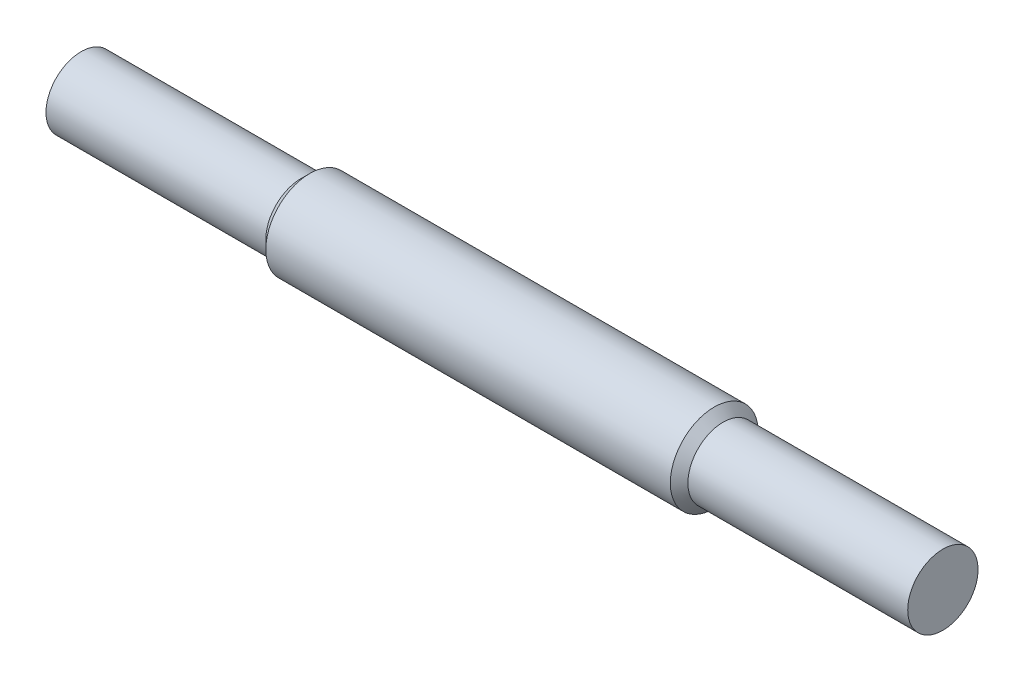
ISO-10303-21;
HEADER;
FILE_DESCRIPTION(('STEP AP214'),'2;1');
FILE_NAME('part.step','',(''),(''),'','','');
FILE_SCHEMA(('AUTOMOTIVE_DESIGN { 1 0 10303 214 1 1 1 1 }'));
ENDSEC;
DATA;
#1=APPLICATION_CONTEXT('core data for automotive mechanical design processes');
#2=APPLICATION_PROTOCOL_DEFINITION('international standard','automotive_design',2000,#1);
#3=PRODUCT_CONTEXT('',#1,'mechanical');
#4=PRODUCT('Part','Part','',(#3));
#5=PRODUCT_RELATED_PRODUCT_CATEGORY('part','',(#4));
#6=PRODUCT_DEFINITION_FORMATION('','',#4);
#7=PRODUCT_DEFINITION_CONTEXT('part definition',#1,'design');
#8=PRODUCT_DEFINITION('design','',#6,#7);
#9=PRODUCT_DEFINITION_SHAPE('','',#8);
#10=(LENGTH_UNIT() NAMED_UNIT(*) SI_UNIT(.MILLI.,.METRE.));
#11=(NAMED_UNIT(*) PLANE_ANGLE_UNIT() SI_UNIT($,.RADIAN.));
#12=(NAMED_UNIT(*) SI_UNIT($,.STERADIAN.) SOLID_ANGLE_UNIT());
#13=UNCERTAINTY_MEASURE_WITH_UNIT(LENGTH_MEASURE(1.E-05),#10,'distance_accuracy_value','');
#14=(GEOMETRIC_REPRESENTATION_CONTEXT(3) GLOBAL_UNCERTAINTY_ASSIGNED_CONTEXT((#13)) GLOBAL_UNIT_ASSIGNED_CONTEXT((#10,
#11,#12)) REPRESENTATION_CONTEXT('',''));
#15=CARTESIAN_POINT('',(0.,0.,0.));
#16=DIRECTION('',(0.,0.,1.));
#17=DIRECTION('',(1.,0.,0.));
#18=AXIS2_PLACEMENT_3D('',#15,#16,#17);
#19=CARTESIAN_POINT('',(-50.,0.,0.));
#20=DIRECTION('',(1.,0.,0.));
#21=DIRECTION('',(0.,0.,-1.));
#22=AXIS2_PLACEMENT_3D('',#19,#20,#21);
#23=PLANE('',#22);
#24=CARTESIAN_POINT('',(-50.,0.,0.));
#25=DIRECTION('',(-1.,0.,0.));
#26=DIRECTION('',(0.,0.,1.));
#27=AXIS2_PLACEMENT_3D('',#24,#25,#26);
#28=CIRCLE('',#27,4.);
#29=CARTESIAN_POINT('',(-50.,0.,4.));
#30=VERTEX_POINT('',#29);
#31=EDGE_CURVE('E10',#30,#30,#28,.T.);
#32=ORIENTED_EDGE('',*,*,#31,.T.);
#33=EDGE_LOOP('',(#32));
#34=FACE_BOUND('',#33,.T.);
#35=ADVANCED_FACE('F32',(#34),#23,.F.);
#36=CARTESIAN_POINT('',(-25.,0.,0.));
#37=DIRECTION('',(-1.,0.,0.));
#38=DIRECTION('',(0.,0.,1.));
#39=AXIS2_PLACEMENT_3D('',#36,#37,#38);
#40=CYLINDRICAL_SURFACE('',#39,4.);
#41=ORIENTED_EDGE('',*,*,#31,.F.);
#42=EDGE_LOOP('',(#41));
#43=FACE_BOUND('',#42,.T.);
#44=CARTESIAN_POINT('',(-25.,0.,0.));
#45=DIRECTION('',(-1.,0.,0.));
#46=DIRECTION('',(0.,0.,1.));
#47=AXIS2_PLACEMENT_3D('',#44,#45,#46);
#48=CIRCLE('',#47,4.);
#49=CARTESIAN_POINT('',(-25.,0.,4.));
#50=VERTEX_POINT('',#49);
#51=EDGE_CURVE('E38',#50,#50,#48,.T.);
#52=ORIENTED_EDGE('',*,*,#51,.T.);
#53=EDGE_LOOP('',(#52));
#54=FACE_BOUND('',#53,.T.);
#55=ADVANCED_FACE('F70',(#43,#54),#40,.T.);
#56=CARTESIAN_POINT('',(-24.,0.,0.));
#57=DIRECTION('',(1.,0.,0.));
#58=DIRECTION('',(0.,0.,-1.));
#59=AXIS2_PLACEMENT_3D('',#56,#57,#58);
#60=CONICAL_SURFACE('',#59,5.,0.785398163397442);
#61=ORIENTED_EDGE('',*,*,#51,.F.);
#62=EDGE_LOOP('',(#61));
#63=FACE_BOUND('',#62,.T.);
#64=CARTESIAN_POINT('',(-24.,0.,0.));
#65=DIRECTION('',(-1.,0.,0.));
#66=DIRECTION('',(0.,0.,1.));
#67=AXIS2_PLACEMENT_3D('',#64,#65,#66);
#68=CIRCLE('',#67,5.);
#69=CARTESIAN_POINT('',(-24.,0.,5.));
#70=VERTEX_POINT('',#69);
#71=EDGE_CURVE('E42',#70,#70,#68,.T.);
#72=ORIENTED_EDGE('',*,*,#71,.T.);
#73=EDGE_LOOP('',(#72));
#74=FACE_BOUND('',#73,.T.);
#75=ADVANCED_FACE('F74',(#63,#74),#60,.T.);
#76=CARTESIAN_POINT('',(-25.,0.,0.));
#77=DIRECTION('',(-1.,0.,0.));
#78=DIRECTION('',(0.,0.,1.));
#79=AXIS2_PLACEMENT_3D('',#76,#77,#78);
#80=CYLINDRICAL_SURFACE('',#79,5.);
#81=ORIENTED_EDGE('',*,*,#71,.F.);
#82=EDGE_LOOP('',(#81));
#83=FACE_BOUND('',#82,.T.);
#84=CARTESIAN_POINT('',(22.,0.,0.));
#85=DIRECTION('',(-1.,0.,0.));
#86=DIRECTION('',(0.,0.,1.));
#87=AXIS2_PLACEMENT_3D('',#84,#85,#86);
#88=CIRCLE('',#87,5.);
#89=CARTESIAN_POINT('',(22.,0.,5.));
#90=VERTEX_POINT('',#89);
#91=EDGE_CURVE('E46',#90,#90,#88,.T.);
#92=ORIENTED_EDGE('',*,*,#91,.T.);
#93=EDGE_LOOP('',(#92));
#94=FACE_BOUND('',#93,.T.);
#95=ADVANCED_FACE('F79',(#83,#94),#80,.T.);
#96=CARTESIAN_POINT('',(23.,0.,0.));
#97=DIRECTION('',(-1.,0.,0.));
#98=DIRECTION('',(0.,0.,1.));
#99=AXIS2_PLACEMENT_3D('',#96,#97,#98);
#100=CONICAL_SURFACE('',#99,4.,0.785398163397441);
#101=ORIENTED_EDGE('',*,*,#91,.F.);
#102=EDGE_LOOP('',(#101));
#103=FACE_BOUND('',#102,.T.);
#104=CARTESIAN_POINT('',(23.,0.,0.));
#105=DIRECTION('',(-1.,0.,0.));
#106=DIRECTION('',(0.,0.,1.));
#107=AXIS2_PLACEMENT_3D('',#104,#105,#106);
#108=CIRCLE('',#107,4.);
#109=CARTESIAN_POINT('',(23.,0.,4.));
#110=VERTEX_POINT('',#109);
#111=EDGE_CURVE('E51',#110,#110,#108,.T.);
#112=ORIENTED_EDGE('',*,*,#111,.T.);
#113=EDGE_LOOP('',(#112));
#114=FACE_BOUND('',#113,.T.);
#115=ADVANCED_FACE('F66',(#103,#114),#100,.T.);
#116=CARTESIAN_POINT('',(-25.,0.,0.));
#117=DIRECTION('',(-1.,0.,0.));
#118=DIRECTION('',(0.,0.,1.));
#119=AXIS2_PLACEMENT_3D('',#116,#117,#118);
#120=CYLINDRICAL_SURFACE('',#119,4.);
#121=ORIENTED_EDGE('',*,*,#111,.F.);
#122=EDGE_LOOP('',(#121));
#123=FACE_BOUND('',#122,.T.);
#124=CARTESIAN_POINT('',(48.,0.,0.));
#125=DIRECTION('',(-1.,0.,0.));
#126=DIRECTION('',(0.,0.,1.));
#127=AXIS2_PLACEMENT_3D('',#124,#125,#126);
#128=CIRCLE('',#127,4.);
#129=CARTESIAN_POINT('',(48.,0.,4.));
#130=VERTEX_POINT('',#129);
#131=EDGE_CURVE('E54',#130,#130,#128,.T.);
#132=ORIENTED_EDGE('',*,*,#131,.T.);
#133=EDGE_LOOP('',(#132));
#134=FACE_BOUND('',#133,.T.);
#135=ADVANCED_FACE('F58',(#123,#134),#120,.T.);
#136=CARTESIAN_POINT('',(48.,0.,0.));
#137=DIRECTION('',(-1.,0.,0.));
#138=DIRECTION('',(0.,0.,1.));
#139=AXIS2_PLACEMENT_3D('',#136,#137,#138);
#140=PLANE('',#139);
#141=ORIENTED_EDGE('',*,*,#131,.F.);
#142=EDGE_LOOP('',(#141));
#143=FACE_BOUND('',#142,.T.);
#144=ADVANCED_FACE('F60',(#143),#140,.F.);
#145=CLOSED_SHELL('',(#35,#55,#75,#95,#115,#135,#144));
#146=MANIFOLD_SOLID_BREP('B2',#145);
#147=ADVANCED_BREP_SHAPE_REPRESENTATION('',(#18,#146),#14);
#148=SHAPE_DEFINITION_REPRESENTATION(#9,#147);
ENDSEC;
END-ISO-10303-21;
